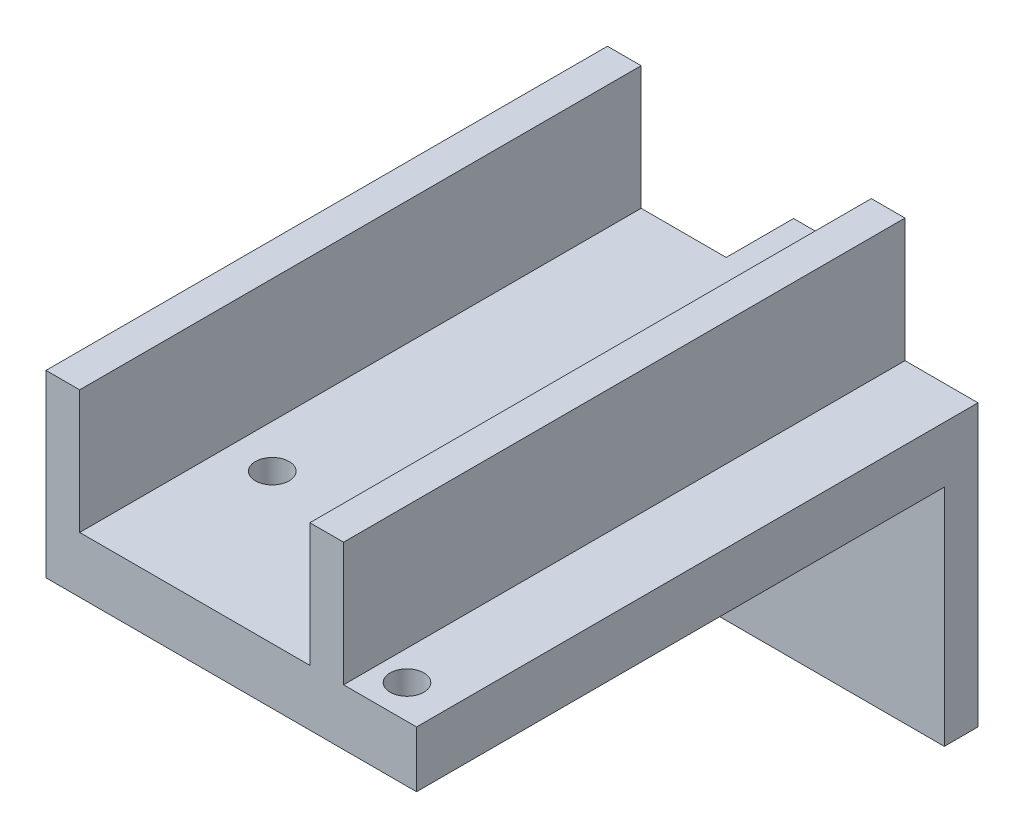
ISO-10303-21;
HEADER;
FILE_DESCRIPTION(('STEP AP214'),'2;1');
FILE_NAME('part.step','',(''),(''),'','','');
FILE_SCHEMA(('AUTOMOTIVE_DESIGN { 1 0 10303 214 1 1 1 1 }'));
ENDSEC;
DATA;
#1=APPLICATION_CONTEXT('core data for automotive mechanical design processes');
#2=APPLICATION_PROTOCOL_DEFINITION('international standard','automotive_design',2000,#1);
#3=PRODUCT_CONTEXT('',#1,'mechanical');
#4=PRODUCT('Part','Part','',(#3));
#5=PRODUCT_RELATED_PRODUCT_CATEGORY('part','',(#4));
#6=PRODUCT_DEFINITION_FORMATION('','',#4);
#7=PRODUCT_DEFINITION_CONTEXT('part definition',#1,'design');
#8=PRODUCT_DEFINITION('design','',#6,#7);
#9=PRODUCT_DEFINITION_SHAPE('','',#8);
#10=(LENGTH_UNIT() NAMED_UNIT(*) SI_UNIT(.MILLI.,.METRE.));
#11=(NAMED_UNIT(*) PLANE_ANGLE_UNIT() SI_UNIT($,.RADIAN.));
#12=(NAMED_UNIT(*) SI_UNIT($,.STERADIAN.) SOLID_ANGLE_UNIT());
#13=UNCERTAINTY_MEASURE_WITH_UNIT(LENGTH_MEASURE(1.E-05),#10,'distance_accuracy_value','');
#14=(GEOMETRIC_REPRESENTATION_CONTEXT(3) GLOBAL_UNCERTAINTY_ASSIGNED_CONTEXT((#13)) GLOBAL_UNIT_ASSIGNED_CONTEXT((#10,
#11,#12)) REPRESENTATION_CONTEXT('',''));
#15=CARTESIAN_POINT('',(0.,0.,0.));
#16=DIRECTION('',(0.,0.,1.));
#17=DIRECTION('',(1.,0.,0.));
#18=AXIS2_PLACEMENT_3D('',#15,#16,#17);
#19=CARTESIAN_POINT('',(0.,5.,0.));
#20=DIRECTION('',(0.,1.,0.));
#21=DIRECTION('',(0.,0.,1.));
#22=AXIS2_PLACEMENT_3D('',#19,#20,#21);
#23=PLANE('',#22);
#24=DIRECTION('',(0.,0.,1.));
#25=VECTOR('',#24,1.);
#26=CARTESIAN_POINT('',(5.5,5.,0.));
#27=LINE('',#26,#25);
#28=CARTESIAN_POINT('',(5.5,5.,-25.));
#29=VERTEX_POINT('',#28);
#30=CARTESIAN_POINT('',(5.5,5.,25.));
#31=VERTEX_POINT('',#30);
#32=EDGE_CURVE('E56',#29,#31,#27,.T.);
#33=ORIENTED_EDGE('',*,*,#32,.F.);
#34=DIRECTION('',(-1.,0.,0.));
#35=VECTOR('',#34,1.);
#36=CARTESIAN_POINT('',(-15.,5.,-25.));
#37=LINE('',#36,#35);
#38=CARTESIAN_POINT('',(-2.575,5.,-25.));
#39=VERTEX_POINT('',#38);
#40=EDGE_CURVE('E283',#29,#39,#37,.T.);
#41=ORIENTED_EDGE('',*,*,#40,.T.);
#42=DIRECTION('',(0.,0.,1.));
#43=VECTOR('',#42,1.);
#44=CARTESIAN_POINT('',(-2.575,5.,-31.));
#45=LINE('',#44,#43);
#46=CARTESIAN_POINT('',(-2.575,5.,-31.));
#47=VERTEX_POINT('',#46);
#48=EDGE_CURVE('E237',#47,#39,#45,.T.);
#49=ORIENTED_EDGE('',*,*,#48,.F.);
#50=DIRECTION('',(-1.,0.,0.));
#51=VECTOR('',#50,1.);
#52=CARTESIAN_POINT('',(-2.575,5.,-31.));
#53=LINE('',#52,#51);
#54=CARTESIAN_POINT('',(-7.425,5.,-31.));
#55=VERTEX_POINT('',#54);
#56=EDGE_CURVE('E219',#47,#55,#53,.T.);
#57=ORIENTED_EDGE('',*,*,#56,.T.);
#58=DIRECTION('',(0.,0.,1.));
#59=VECTOR('',#58,1.);
#60=CARTESIAN_POINT('',(-7.425,5.,-31.));
#61=LINE('',#60,#59);
#62=CARTESIAN_POINT('',(-7.425,5.,-25.));
#63=VERTEX_POINT('',#62);
#64=EDGE_CURVE('E230',#55,#63,#61,.T.);
#65=ORIENTED_EDGE('',*,*,#64,.T.);
#66=CARTESIAN_POINT('',(-15.,5.,-25.));
#67=VERTEX_POINT('',#66);
#68=EDGE_CURVE('E279',#63,#67,#37,.T.);
#69=ORIENTED_EDGE('',*,*,#68,.T.);
#70=DIRECTION('',(0.,0.,1.));
#71=VECTOR('',#70,1.);
#72=CARTESIAN_POINT('',(-15.,5.,-25.));
#73=LINE('',#72,#71);
#74=CARTESIAN_POINT('',(-15.,5.,25.));
#75=VERTEX_POINT('',#74);
#76=EDGE_CURVE('E272',#67,#75,#73,.T.);
#77=ORIENTED_EDGE('',*,*,#76,.T.);
#78=DIRECTION('',(1.,0.,0.));
#79=VECTOR('',#78,1.);
#80=CARTESIAN_POINT('',(-15.,5.,25.));
#81=LINE('',#80,#79);
#82=EDGE_CURVE('E52',#75,#31,#81,.T.);
#83=ORIENTED_EDGE('',*,*,#82,.T.);
#84=EDGE_LOOP('',(#33,#41,#49,#57,#65,#69,#77,#83));
#85=FACE_BOUND('',#84,.T.);
#86=CARTESIAN_POINT('',(-11.15,5.,11.7));
#87=DIRECTION('',(0.,1.,0.));
#88=DIRECTION('',(0.,0.,1.));
#89=AXIS2_PLACEMENT_3D('',#86,#87,#88);
#90=CIRCLE('',#89,1.5);
#91=CARTESIAN_POINT('',(-11.15,5.,13.2));
#92=VERTEX_POINT('',#91);
#93=EDGE_CURVE('E266',#92,#92,#90,.T.);
#94=ORIENTED_EDGE('',*,*,#93,.F.);
#95=EDGE_LOOP('',(#94));
#96=FACE_BOUND('',#95,.T.);
#97=ADVANCED_FACE('F37',(#85,#96),#23,.T.);
#98=CARTESIAN_POINT('',(-15.,5.,-25.));
#99=DIRECTION('',(1.,0.,0.));
#100=DIRECTION('',(0.,0.,-1.));
#101=AXIS2_PLACEMENT_3D('',#98,#99,#100);
#102=PLANE('',#101);
#103=DIRECTION('',(0.,0.,1.));
#104=VECTOR('',#103,1.);
#105=CARTESIAN_POINT('',(-15.,0.,-25.));
#106=LINE('',#105,#104);
#107=CARTESIAN_POINT('',(-15.,0.,-25.));
#108=VERTEX_POINT('',#107);
#109=CARTESIAN_POINT('',(-15.,0.,-22.));
#110=VERTEX_POINT('',#109);
#111=EDGE_CURVE('E208',#108,#110,#106,.T.);
#112=ORIENTED_EDGE('',*,*,#111,.F.);
#113=DIRECTION('',(0.,-1.,0.));
#114=VECTOR('',#113,1.);
#115=CARTESIAN_POINT('',(-15.,5.,-25.));
#116=LINE('',#115,#114);
#117=CARTESIAN_POINT('',(-15.,-20.,-25.));
#118=VERTEX_POINT('',#117);
#119=EDGE_CURVE('E282',#108,#118,#116,.T.);
#120=ORIENTED_EDGE('',*,*,#119,.T.);
#121=DIRECTION('',(0.,0.,-1.));
#122=VECTOR('',#121,1.);
#123=CARTESIAN_POINT('',(-15.,-20.,-22.));
#124=LINE('',#123,#122);
#125=CARTESIAN_POINT('',(-15.,-20.,-22.));
#126=VERTEX_POINT('',#125);
#127=EDGE_CURVE('E260',#126,#118,#124,.T.);
#128=ORIENTED_EDGE('',*,*,#127,.F.);
#129=DIRECTION('',(0.,1.,0.));
#130=VECTOR('',#129,1.);
#131=CARTESIAN_POINT('',(-15.,5.,-22.));
#132=LINE('',#131,#130);
#133=EDGE_CURVE('E249',#126,#110,#132,.T.);
#134=ORIENTED_EDGE('',*,*,#133,.T.);
#135=EDGE_LOOP('',(#112,#120,#128,#134));
#136=FACE_BOUND('',#135,.T.);
#137=ADVANCED_FACE('F39',(#136),#102,.F.);
#138=CARTESIAN_POINT('',(-15.,5.,25.));
#139=DIRECTION('',(0.,0.,-1.));
#140=DIRECTION('',(-1.,0.,0.));
#141=AXIS2_PLACEMENT_3D('',#138,#139,#140);
#142=PLANE('',#141);
#143=CARTESIAN_POINT('',(8.5,5.,25.));
#144=VERTEX_POINT('',#143);
#145=CARTESIAN_POINT('',(15.,5.,25.));
#146=VERTEX_POINT('',#145);
#147=EDGE_CURVE('E274',#144,#146,#81,.T.);
#148=ORIENTED_EDGE('',*,*,#147,.F.);
#149=DIRECTION('',(0.,1.,0.));
#150=VECTOR('',#149,1.);
#151=CARTESIAN_POINT('',(8.5,0.,25.));
#152=LINE('',#151,#150);
#153=CARTESIAN_POINT('',(8.5,16.,25.));
#154=VERTEX_POINT('',#153);
#155=EDGE_CURVE('E171',#144,#154,#152,.T.);
#156=ORIENTED_EDGE('',*,*,#155,.T.);
#157=DIRECTION('',(-1.,0.,0.));
#158=VECTOR('',#157,1.);
#159=CARTESIAN_POINT('',(5.5,16.,25.));
#160=LINE('',#159,#158);
#161=CARTESIAN_POINT('',(5.5,16.,25.));
#162=VERTEX_POINT('',#161);
#163=EDGE_CURVE('E158',#154,#162,#160,.T.);
#164=ORIENTED_EDGE('',*,*,#163,.T.);
#165=DIRECTION('',(0.,-1.,0.));
#166=VECTOR('',#165,1.);
#167=CARTESIAN_POINT('',(5.5,0.,25.));
#168=LINE('',#167,#166);
#169=EDGE_CURVE('E167',#162,#31,#168,.T.);
#170=ORIENTED_EDGE('',*,*,#169,.T.);
#171=ORIENTED_EDGE('',*,*,#82,.F.);
#172=DIRECTION('',(0.,1.,0.));
#173=VECTOR('',#172,1.);
#174=CARTESIAN_POINT('',(-15.,0.,25.));
#175=LINE('',#174,#173);
#176=CARTESIAN_POINT('',(-15.,16.,25.));
#177=VERTEX_POINT('',#176);
#178=EDGE_CURVE('E188',#75,#177,#175,.T.);
#179=ORIENTED_EDGE('',*,*,#178,.T.);
#180=DIRECTION('',(-1.,0.,0.));
#181=VECTOR('',#180,1.);
#182=CARTESIAN_POINT('',(-15.,16.,25.));
#183=LINE('',#182,#181);
#184=CARTESIAN_POINT('',(-18.,16.,25.));
#185=VERTEX_POINT('',#184);
#186=EDGE_CURVE('E203',#177,#185,#183,.T.);
#187=ORIENTED_EDGE('',*,*,#186,.T.);
#188=DIRECTION('',(0.,-1.,0.));
#189=VECTOR('',#188,1.);
#190=CARTESIAN_POINT('',(-18.,0.,25.));
#191=LINE('',#190,#189);
#192=CARTESIAN_POINT('',(-18.,0.,25.));
#193=VERTEX_POINT('',#192);
#194=EDGE_CURVE('E192',#185,#193,#191,.T.);
#195=ORIENTED_EDGE('',*,*,#194,.T.);
#196=DIRECTION('',(1.,0.,0.));
#197=VECTOR('',#196,1.);
#198=CARTESIAN_POINT('',(-15.,0.,25.));
#199=LINE('',#198,#197);
#200=CARTESIAN_POINT('',(15.,0.,25.));
#201=VERTEX_POINT('',#200);
#202=EDGE_CURVE('E284',#193,#201,#199,.T.);
#203=ORIENTED_EDGE('',*,*,#202,.T.);
#204=DIRECTION('',(0.,-1.,0.));
#205=VECTOR('',#204,1.);
#206=CARTESIAN_POINT('',(15.,5.,25.));
#207=LINE('',#206,#205);
#208=EDGE_CURVE('E45',#146,#201,#207,.T.);
#209=ORIENTED_EDGE('',*,*,#208,.F.);
#210=EDGE_LOOP('',(#148,#156,#164,#170,#171,#179,#187,#195,#203,#209));
#211=FACE_BOUND('',#210,.T.);
#212=ADVANCED_FACE('F173',(#211),#142,.F.);
#213=CARTESIAN_POINT('',(15.,5.,-25.));
#214=DIRECTION('',(-1.,0.,0.));
#215=DIRECTION('',(0.,0.,1.));
#216=AXIS2_PLACEMENT_3D('',#213,#214,#215);
#217=PLANE('',#216);
#218=DIRECTION('',(0.,0.,-1.));
#219=VECTOR('',#218,1.);
#220=CARTESIAN_POINT('',(15.,0.,-25.));
#221=LINE('',#220,#219);
#222=CARTESIAN_POINT('',(15.,0.,-22.));
#223=VERTEX_POINT('',#222);
#224=EDGE_CURVE('E275',#201,#223,#221,.T.);
#225=ORIENTED_EDGE('',*,*,#224,.T.);
#226=DIRECTION('',(0.,-1.,0.));
#227=VECTOR('',#226,1.);
#228=CARTESIAN_POINT('',(15.,5.,-22.));
#229=LINE('',#228,#227);
#230=CARTESIAN_POINT('',(15.,-20.,-22.));
#231=VERTEX_POINT('',#230);
#232=EDGE_CURVE('E252',#223,#231,#229,.T.);
#233=ORIENTED_EDGE('',*,*,#232,.T.);
#234=DIRECTION('',(0.,0.,-1.));
#235=VECTOR('',#234,1.);
#236=CARTESIAN_POINT('',(15.,-20.,-22.));
#237=LINE('',#236,#235);
#238=CARTESIAN_POINT('',(15.,-20.,-25.));
#239=VERTEX_POINT('',#238);
#240=EDGE_CURVE('E257',#231,#239,#237,.T.);
#241=ORIENTED_EDGE('',*,*,#240,.T.);
#242=DIRECTION('',(0.,-1.,0.));
#243=VECTOR('',#242,1.);
#244=CARTESIAN_POINT('',(15.,5.,-25.));
#245=LINE('',#244,#243);
#246=CARTESIAN_POINT('',(15.,5.,-25.));
#247=VERTEX_POINT('',#246);
#248=EDGE_CURVE('E290',#247,#239,#245,.T.);
#249=ORIENTED_EDGE('',*,*,#248,.F.);
#250=DIRECTION('',(0.,0.,-1.));
#251=VECTOR('',#250,1.);
#252=CARTESIAN_POINT('',(15.,5.,-25.));
#253=LINE('',#252,#251);
#254=EDGE_CURVE('E277',#146,#247,#253,.T.);
#255=ORIENTED_EDGE('',*,*,#254,.F.);
#256=ORIENTED_EDGE('',*,*,#208,.T.);
#257=EDGE_LOOP('',(#225,#233,#241,#249,#255,#256));
#258=FACE_BOUND('',#257,.T.);
#259=ADVANCED_FACE('F436',(#258),#217,.F.);
#260=CARTESIAN_POINT('',(-15.,5.,-25.));
#261=DIRECTION('',(0.,0.,1.));
#262=DIRECTION('',(1.,0.,0.));
#263=AXIS2_PLACEMENT_3D('',#260,#261,#262);
#264=PLANE('',#263);
#265=DIRECTION('',(0.,1.,0.));
#266=VECTOR('',#265,1.);
#267=CARTESIAN_POINT('',(8.5,0.,-25.));
#268=LINE('',#267,#266);
#269=CARTESIAN_POINT('',(8.5,5.,-25.));
#270=VERTEX_POINT('',#269);
#271=CARTESIAN_POINT('',(8.5,16.,-25.));
#272=VERTEX_POINT('',#271);
#273=EDGE_CURVE('E179',#270,#272,#268,.T.);
#274=ORIENTED_EDGE('',*,*,#273,.F.);
#275=EDGE_CURVE('E280',#247,#270,#37,.T.);
#276=ORIENTED_EDGE('',*,*,#275,.F.);
#277=ORIENTED_EDGE('',*,*,#248,.T.);
#278=DIRECTION('',(-1.,0.,0.));
#279=VECTOR('',#278,1.);
#280=CARTESIAN_POINT('',(-15.,-20.,-25.));
#281=LINE('',#280,#279);
#282=EDGE_CURVE('E240',#239,#118,#281,.T.);
#283=ORIENTED_EDGE('',*,*,#282,.T.);
#284=ORIENTED_EDGE('',*,*,#119,.F.);
#285=DIRECTION('',(1.,0.,0.));
#286=VECTOR('',#285,1.);
#287=CARTESIAN_POINT('',(-15.,0.,-25.));
#288=LINE('',#287,#286);
#289=CARTESIAN_POINT('',(-18.,0.,-25.));
#290=VERTEX_POINT('',#289);
#291=EDGE_CURVE('E198',#290,#108,#288,.T.);
#292=ORIENTED_EDGE('',*,*,#291,.F.);
#293=DIRECTION('',(0.,-1.,0.));
#294=VECTOR('',#293,1.);
#295=CARTESIAN_POINT('',(-18.,0.,-25.));
#296=LINE('',#295,#294);
#297=CARTESIAN_POINT('',(-18.,16.,-25.));
#298=VERTEX_POINT('',#297);
#299=EDGE_CURVE('E195',#298,#290,#296,.T.);
#300=ORIENTED_EDGE('',*,*,#299,.F.);
#301=DIRECTION('',(-1.,0.,0.));
#302=VECTOR('',#301,1.);
#303=CARTESIAN_POINT('',(-15.,16.,-25.));
#304=LINE('',#303,#302);
#305=CARTESIAN_POINT('',(-15.,16.,-25.));
#306=VERTEX_POINT('',#305);
#307=EDGE_CURVE('E191',#306,#298,#304,.T.);
#308=ORIENTED_EDGE('',*,*,#307,.F.);
#309=DIRECTION('',(0.,1.,0.));
#310=VECTOR('',#309,1.);
#311=CARTESIAN_POINT('',(-15.,0.,-25.));
#312=LINE('',#311,#310);
#313=EDGE_CURVE('E189',#67,#306,#312,.T.);
#314=ORIENTED_EDGE('',*,*,#313,.F.);
#315=ORIENTED_EDGE('',*,*,#68,.F.);
#316=DIRECTION('',(0.,-1.,0.));
#317=VECTOR('',#316,1.);
#318=CARTESIAN_POINT('',(-7.425,5.,-25.));
#319=LINE('',#318,#317);
#320=CARTESIAN_POINT('',(-7.425,-15.,-25.));
#321=VERTEX_POINT('',#320);
#322=EDGE_CURVE('E211',#63,#321,#319,.T.);
#323=ORIENTED_EDGE('',*,*,#322,.T.);
#324=DIRECTION('',(-1.,0.,0.));
#325=VECTOR('',#324,1.);
#326=CARTESIAN_POINT('',(-2.575,-15.,-25.));
#327=LINE('',#326,#325);
#328=CARTESIAN_POINT('',(-2.575,-15.,-25.));
#329=VERTEX_POINT('',#328);
#330=EDGE_CURVE('E232',#329,#321,#327,.T.);
#331=ORIENTED_EDGE('',*,*,#330,.F.);
#332=DIRECTION('',(0.,-1.,0.));
#333=VECTOR('',#332,1.);
#334=CARTESIAN_POINT('',(-2.575,5.,-25.));
#335=LINE('',#334,#333);
#336=EDGE_CURVE('E223',#39,#329,#335,.T.);
#337=ORIENTED_EDGE('',*,*,#336,.F.);
#338=ORIENTED_EDGE('',*,*,#40,.F.);
#339=DIRECTION('',(0.,-1.,0.));
#340=VECTOR('',#339,1.);
#341=CARTESIAN_POINT('',(5.5,0.,-25.));
#342=LINE('',#341,#340);
#343=CARTESIAN_POINT('',(5.5,16.,-25.));
#344=VERTEX_POINT('',#343);
#345=EDGE_CURVE('E176',#344,#29,#342,.T.);
#346=ORIENTED_EDGE('',*,*,#345,.F.);
#347=DIRECTION('',(-1.,0.,0.));
#348=VECTOR('',#347,1.);
#349=CARTESIAN_POINT('',(5.5,16.,-25.));
#350=LINE('',#349,#348);
#351=EDGE_CURVE('E160',#272,#344,#350,.T.);
#352=ORIENTED_EDGE('',*,*,#351,.F.);
#353=EDGE_LOOP('',(#274,#276,#277,#283,#284,#292,#300,#308,#314,#315,#323,#331,#337,#338,#346,#352));
#354=FACE_BOUND('',#353,.T.);
#355=ADVANCED_FACE('F312',(#354),#264,.F.);
#356=DIRECTION('',(0.,0.,-1.));
#357=VECTOR('',#356,1.);
#358=CARTESIAN_POINT('',(8.5,5.,0.));
#359=LINE('',#358,#357);
#360=EDGE_CURVE('E170',#144,#270,#359,.T.);
#361=ORIENTED_EDGE('',*,*,#360,.F.);
#362=ORIENTED_EDGE('',*,*,#147,.T.);
#363=ORIENTED_EDGE('',*,*,#254,.T.);
#364=ORIENTED_EDGE('',*,*,#275,.T.);
#365=EDGE_LOOP('',(#361,#362,#363,#364));
#366=FACE_BOUND('',#365,.T.);
#367=CARTESIAN_POINT('',(11.15,5.,22.));
#368=DIRECTION('',(0.,1.,0.));
#369=DIRECTION('',(0.,0.,1.));
#370=AXIS2_PLACEMENT_3D('',#367,#368,#369);
#371=CIRCLE('',#370,1.5);
#372=CARTESIAN_POINT('',(11.15,5.,23.5));
#373=VERTEX_POINT('',#372);
#374=EDGE_CURVE('E263',#373,#373,#371,.T.);
#375=ORIENTED_EDGE('',*,*,#374,.F.);
#376=EDGE_LOOP('',(#375));
#377=FACE_BOUND('',#376,.T.);
#378=ADVANCED_FACE('F303',(#366,#377),#23,.T.);
#379=CARTESIAN_POINT('',(0.,0.,0.));
#380=DIRECTION('',(0.,1.,0.));
#381=DIRECTION('',(0.,0.,1.));
#382=AXIS2_PLACEMENT_3D('',#379,#380,#381);
#383=PLANE('',#382);
#384=CARTESIAN_POINT('',(11.15,0.,22.));
#385=DIRECTION('',(0.,1.,0.));
#386=DIRECTION('',(0.,0.,1.));
#387=AXIS2_PLACEMENT_3D('',#384,#385,#386);
#388=CIRCLE('',#387,1.5);
#389=CARTESIAN_POINT('',(11.15,0.,23.5));
#390=VERTEX_POINT('',#389);
#391=EDGE_CURVE('E269',#390,#390,#388,.F.);
#392=ORIENTED_EDGE('',*,*,#391,.F.);
#393=EDGE_LOOP('',(#392));
#394=FACE_BOUND('',#393,.T.);
#395=ORIENTED_EDGE('',*,*,#224,.F.);
#396=ORIENTED_EDGE('',*,*,#202,.F.);
#397=DIRECTION('',(0.,0.,1.));
#398=VECTOR('',#397,1.);
#399=CARTESIAN_POINT('',(-18.,0.,-25.));
#400=LINE('',#399,#398);
#401=EDGE_CURVE('E212',#290,#193,#400,.T.);
#402=ORIENTED_EDGE('',*,*,#401,.F.);
#403=ORIENTED_EDGE('',*,*,#291,.T.);
#404=ORIENTED_EDGE('',*,*,#111,.T.);
#405=DIRECTION('',(1.,0.,0.));
#406=VECTOR('',#405,1.);
#407=CARTESIAN_POINT('',(0.,0.,-22.));
#408=LINE('',#407,#406);
#409=EDGE_CURVE('E11',#110,#223,#408,.T.);
#410=ORIENTED_EDGE('',*,*,#409,.T.);
#411=EDGE_LOOP('',(#395,#396,#402,#403,#404,#410));
#412=FACE_BOUND('',#411,.T.);
#413=CARTESIAN_POINT('',(-11.15,0.,11.7));
#414=DIRECTION('',(0.,1.,0.));
#415=DIRECTION('',(0.,0.,1.));
#416=AXIS2_PLACEMENT_3D('',#413,#414,#415);
#417=CIRCLE('',#416,1.5);
#418=CARTESIAN_POINT('',(-11.15,0.,13.2));
#419=VERTEX_POINT('',#418);
#420=EDGE_CURVE('E286',#419,#419,#417,.F.);
#421=ORIENTED_EDGE('',*,*,#420,.F.);
#422=EDGE_LOOP('',(#421));
#423=FACE_BOUND('',#422,.T.);
#424=ADVANCED_FACE('F300',(#394,#412,#423),#383,.F.);
#425=CARTESIAN_POINT('',(11.15,5.,22.));
#426=DIRECTION('',(0.,-1.,0.));
#427=DIRECTION('',(0.,0.,-1.));
#428=AXIS2_PLACEMENT_3D('',#425,#426,#427);
#429=CYLINDRICAL_SURFACE('',#428,1.5);
#430=ORIENTED_EDGE('',*,*,#374,.T.);
#431=EDGE_LOOP('',(#430));
#432=FACE_BOUND('',#431,.T.);
#433=ORIENTED_EDGE('',*,*,#391,.T.);
#434=EDGE_LOOP('',(#433));
#435=FACE_BOUND('',#434,.T.);
#436=ADVANCED_FACE('F302',(#432,#435),#429,.F.);
#437=CARTESIAN_POINT('',(-11.15,5.,11.7));
#438=DIRECTION('',(0.,-1.,0.));
#439=DIRECTION('',(0.,0.,-1.));
#440=AXIS2_PLACEMENT_3D('',#437,#438,#439);
#441=CYLINDRICAL_SURFACE('',#440,1.5);
#442=ORIENTED_EDGE('',*,*,#93,.T.);
#443=EDGE_LOOP('',(#442));
#444=FACE_BOUND('',#443,.T.);
#445=ORIENTED_EDGE('',*,*,#420,.T.);
#446=EDGE_LOOP('',(#445));
#447=FACE_BOUND('',#446,.T.);
#448=ADVANCED_FACE('F298',(#444,#447),#441,.F.);
#449=CARTESIAN_POINT('',(0.,0.,-22.));
#450=DIRECTION('',(0.,0.,1.));
#451=DIRECTION('',(1.,0.,0.));
#452=AXIS2_PLACEMENT_3D('',#449,#450,#451);
#453=PLANE('',#452);
#454=ORIENTED_EDGE('',*,*,#409,.F.);
#455=ORIENTED_EDGE('',*,*,#133,.F.);
#456=DIRECTION('',(-1.,0.,0.));
#457=VECTOR('',#456,1.);
#458=CARTESIAN_POINT('',(-15.,-20.,-22.));
#459=LINE('',#458,#457);
#460=EDGE_CURVE('E254',#231,#126,#459,.T.);
#461=ORIENTED_EDGE('',*,*,#460,.F.);
#462=ORIENTED_EDGE('',*,*,#232,.F.);
#463=EDGE_LOOP('',(#454,#455,#461,#462));
#464=FACE_BOUND('',#463,.T.);
#465=ADVANCED_FACE('F327',(#464),#453,.T.);
#466=CARTESIAN_POINT('',(-15.,-20.,-22.));
#467=DIRECTION('',(0.,-1.,0.));
#468=DIRECTION('',(0.,0.,-1.));
#469=AXIS2_PLACEMENT_3D('',#466,#467,#468);
#470=PLANE('',#469);
#471=ORIENTED_EDGE('',*,*,#282,.F.);
#472=ORIENTED_EDGE('',*,*,#240,.F.);
#473=ORIENTED_EDGE('',*,*,#460,.T.);
#474=ORIENTED_EDGE('',*,*,#127,.T.);
#475=EDGE_LOOP('',(#471,#472,#473,#474));
#476=FACE_BOUND('',#475,.T.);
#477=ADVANCED_FACE('F329',(#476),#470,.T.);
#478=CARTESIAN_POINT('',(-2.575,5.,-31.));
#479=DIRECTION('',(-1.,0.,0.));
#480=DIRECTION('',(0.,-1.,0.));
#481=AXIS2_PLACEMENT_3D('',#478,#479,#480);
#482=PLANE('',#481);
#483=ORIENTED_EDGE('',*,*,#336,.T.);
#484=DIRECTION('',(0.,0.,1.));
#485=VECTOR('',#484,1.);
#486=CARTESIAN_POINT('',(-2.575,-15.,-31.));
#487=LINE('',#486,#485);
#488=CARTESIAN_POINT('',(-2.575,-15.,-31.));
#489=VERTEX_POINT('',#488);
#490=EDGE_CURVE('E241',#489,#329,#487,.T.);
#491=ORIENTED_EDGE('',*,*,#490,.F.);
#492=DIRECTION('',(0.,-1.,0.));
#493=VECTOR('',#492,1.);
#494=CARTESIAN_POINT('',(-2.575,5.,-31.));
#495=LINE('',#494,#493);
#496=EDGE_CURVE('E228',#47,#489,#495,.T.);
#497=ORIENTED_EDGE('',*,*,#496,.F.);
#498=ORIENTED_EDGE('',*,*,#48,.T.);
#499=EDGE_LOOP('',(#483,#491,#497,#498));
#500=FACE_BOUND('',#499,.T.);
#501=ADVANCED_FACE('F332',(#500),#482,.F.);
#502=CARTESIAN_POINT('',(-2.575,-15.,-31.));
#503=DIRECTION('',(0.,1.,0.));
#504=DIRECTION('',(-1.,0.,0.));
#505=AXIS2_PLACEMENT_3D('',#502,#503,#504);
#506=PLANE('',#505);
#507=ORIENTED_EDGE('',*,*,#330,.T.);
#508=DIRECTION('',(0.,0.,1.));
#509=VECTOR('',#508,1.);
#510=CARTESIAN_POINT('',(-7.425,-15.,-31.));
#511=LINE('',#510,#509);
#512=CARTESIAN_POINT('',(-7.425,-15.,-31.));
#513=VERTEX_POINT('',#512);
#514=EDGE_CURVE('E244',#513,#321,#511,.T.);
#515=ORIENTED_EDGE('',*,*,#514,.F.);
#516=DIRECTION('',(-1.,0.,0.));
#517=VECTOR('',#516,1.);
#518=CARTESIAN_POINT('',(-2.575,-15.,-31.));
#519=LINE('',#518,#517);
#520=EDGE_CURVE('E226',#489,#513,#519,.T.);
#521=ORIENTED_EDGE('',*,*,#520,.F.);
#522=ORIENTED_EDGE('',*,*,#490,.T.);
#523=EDGE_LOOP('',(#507,#515,#521,#522));
#524=FACE_BOUND('',#523,.T.);
#525=ADVANCED_FACE('F341',(#524),#506,.F.);
#526=CARTESIAN_POINT('',(-7.425,5.,-31.));
#527=DIRECTION('',(-1.,0.,0.));
#528=DIRECTION('',(0.,-1.,0.));
#529=AXIS2_PLACEMENT_3D('',#526,#527,#528);
#530=PLANE('',#529);
#531=ORIENTED_EDGE('',*,*,#322,.F.);
#532=ORIENTED_EDGE('',*,*,#64,.F.);
#533=DIRECTION('',(0.,-1.,0.));
#534=VECTOR('',#533,1.);
#535=CARTESIAN_POINT('',(-7.425,5.,-31.));
#536=LINE('',#535,#534);
#537=EDGE_CURVE('E222',#55,#513,#536,.T.);
#538=ORIENTED_EDGE('',*,*,#537,.T.);
#539=ORIENTED_EDGE('',*,*,#514,.T.);
#540=EDGE_LOOP('',(#531,#532,#538,#539));
#541=FACE_BOUND('',#540,.T.);
#542=ADVANCED_FACE('F337',(#541),#530,.T.);
#543=CARTESIAN_POINT('',(0.,0.,-31.));
#544=DIRECTION('',(0.,0.,1.));
#545=DIRECTION('',(1.,0.,0.));
#546=AXIS2_PLACEMENT_3D('',#543,#544,#545);
#547=PLANE('',#546);
#548=ORIENTED_EDGE('',*,*,#56,.F.);
#549=ORIENTED_EDGE('',*,*,#496,.T.);
#550=ORIENTED_EDGE('',*,*,#520,.T.);
#551=ORIENTED_EDGE('',*,*,#537,.F.);
#552=EDGE_LOOP('',(#548,#549,#550,#551));
#553=FACE_BOUND('',#552,.T.);
#554=ADVANCED_FACE('F340',(#553),#547,.F.);
#555=CARTESIAN_POINT('',(-15.,0.,-25.));
#556=DIRECTION('',(1.,0.,0.));
#557=DIRECTION('',(0.,0.,-1.));
#558=AXIS2_PLACEMENT_3D('',#555,#556,#557);
#559=PLANE('',#558);
#560=ORIENTED_EDGE('',*,*,#76,.F.);
#561=ORIENTED_EDGE('',*,*,#313,.T.);
#562=DIRECTION('',(0.,0.,1.));
#563=VECTOR('',#562,1.);
#564=CARTESIAN_POINT('',(-15.,16.,-25.));
#565=LINE('',#564,#563);
#566=EDGE_CURVE('E201',#306,#177,#565,.T.);
#567=ORIENTED_EDGE('',*,*,#566,.T.);
#568=ORIENTED_EDGE('',*,*,#178,.F.);
#569=EDGE_LOOP('',(#560,#561,#567,#568));
#570=FACE_BOUND('',#569,.T.);
#571=ADVANCED_FACE('F351',(#570),#559,.T.);
#572=CARTESIAN_POINT('',(-18.,0.,-25.));
#573=DIRECTION('',(-1.,0.,0.));
#574=DIRECTION('',(0.,0.,1.));
#575=AXIS2_PLACEMENT_3D('',#572,#573,#574);
#576=PLANE('',#575);
#577=ORIENTED_EDGE('',*,*,#194,.F.);
#578=DIRECTION('',(0.,0.,1.));
#579=VECTOR('',#578,1.);
#580=CARTESIAN_POINT('',(-18.,16.,-25.));
#581=LINE('',#580,#579);
#582=EDGE_CURVE('E215',#298,#185,#581,.T.);
#583=ORIENTED_EDGE('',*,*,#582,.F.);
#584=ORIENTED_EDGE('',*,*,#299,.T.);
#585=ORIENTED_EDGE('',*,*,#401,.T.);
#586=EDGE_LOOP('',(#577,#583,#584,#585));
#587=FACE_BOUND('',#586,.T.);
#588=ADVANCED_FACE('F355',(#587),#576,.T.);
#589=CARTESIAN_POINT('',(-15.,16.,-25.));
#590=DIRECTION('',(0.,1.,0.));
#591=DIRECTION('',(0.,0.,1.));
#592=AXIS2_PLACEMENT_3D('',#589,#590,#591);
#593=PLANE('',#592);
#594=ORIENTED_EDGE('',*,*,#186,.F.);
#595=ORIENTED_EDGE('',*,*,#566,.F.);
#596=ORIENTED_EDGE('',*,*,#307,.T.);
#597=ORIENTED_EDGE('',*,*,#582,.T.);
#598=EDGE_LOOP('',(#594,#595,#596,#597));
#599=FACE_BOUND('',#598,.T.);
#600=ADVANCED_FACE('F357',(#599),#593,.T.);
#601=CARTESIAN_POINT('',(5.5,0.,-25.));
#602=DIRECTION('',(-1.,0.,0.));
#603=DIRECTION('',(0.,-1.,0.));
#604=AXIS2_PLACEMENT_3D('',#601,#602,#603);
#605=PLANE('',#604);
#606=ORIENTED_EDGE('',*,*,#345,.T.);
#607=ORIENTED_EDGE('',*,*,#32,.T.);
#608=ORIENTED_EDGE('',*,*,#169,.F.);
#609=DIRECTION('',(0.,0.,1.));
#610=VECTOR('',#609,1.);
#611=CARTESIAN_POINT('',(5.5,16.,-25.));
#612=LINE('',#611,#610);
#613=EDGE_CURVE('E153',#344,#162,#612,.T.);
#614=ORIENTED_EDGE('',*,*,#613,.F.);
#615=EDGE_LOOP('',(#606,#607,#608,#614));
#616=FACE_BOUND('',#615,.T.);
#617=ADVANCED_FACE('F168',(#616),#605,.T.);
#618=CARTESIAN_POINT('',(5.5,16.,-25.));
#619=DIRECTION('',(0.,1.,0.));
#620=DIRECTION('',(0.,0.,1.));
#621=AXIS2_PLACEMENT_3D('',#618,#619,#620);
#622=PLANE('',#621);
#623=ORIENTED_EDGE('',*,*,#163,.F.);
#624=DIRECTION('',(0.,0.,1.));
#625=VECTOR('',#624,1.);
#626=CARTESIAN_POINT('',(8.5,16.,-25.));
#627=LINE('',#626,#625);
#628=EDGE_CURVE('E164',#272,#154,#627,.T.);
#629=ORIENTED_EDGE('',*,*,#628,.F.);
#630=ORIENTED_EDGE('',*,*,#351,.T.);
#631=ORIENTED_EDGE('',*,*,#613,.T.);
#632=EDGE_LOOP('',(#623,#629,#630,#631));
#633=FACE_BOUND('',#632,.T.);
#634=ADVANCED_FACE('F155',(#633),#622,.T.);
#635=CARTESIAN_POINT('',(8.5,0.,-25.));
#636=DIRECTION('',(1.,0.,0.));
#637=DIRECTION('',(0.,0.,-1.));
#638=AXIS2_PLACEMENT_3D('',#635,#636,#637);
#639=PLANE('',#638);
#640=ORIENTED_EDGE('',*,*,#155,.F.);
#641=ORIENTED_EDGE('',*,*,#360,.T.);
#642=ORIENTED_EDGE('',*,*,#273,.T.);
#643=ORIENTED_EDGE('',*,*,#628,.T.);
#644=EDGE_LOOP('',(#640,#641,#642,#643));
#645=FACE_BOUND('',#644,.T.);
#646=ADVANCED_FACE('F366',(#645),#639,.T.);
#647=CLOSED_SHELL('',(#97,#137,#212,#259,#355,#378,#424,#436,#448,#465,#477,#501,#525,#542,#554,
#571,#588,#600,#617,#634,#646));
#648=MANIFOLD_SOLID_BREP('B2',#647);
#649=ADVANCED_BREP_SHAPE_REPRESENTATION('',(#18,#648),#14);
#650=SHAPE_DEFINITION_REPRESENTATION(#9,#649);
ENDSEC;
END-ISO-10303-21;
